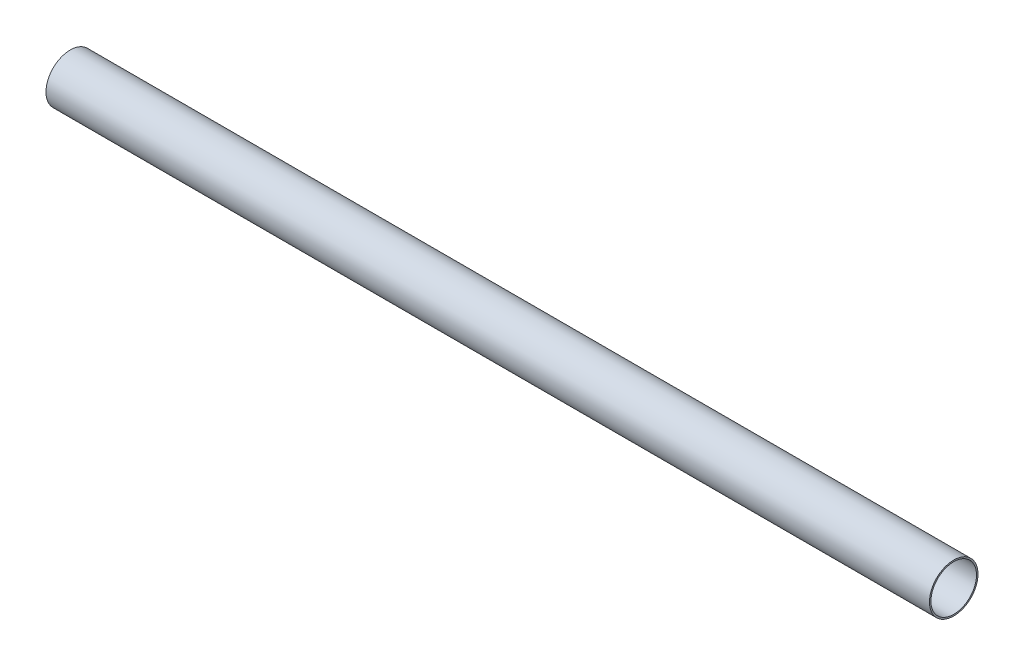
ISO-10303-21;
HEADER;
FILE_DESCRIPTION(('STEP AP214'),'2;1');
FILE_NAME('part.step','',(''),(''),'','','');
FILE_SCHEMA(('AUTOMOTIVE_DESIGN { 1 0 10303 214 1 1 1 1 }'));
ENDSEC;
DATA;
#1=APPLICATION_CONTEXT('core data for automotive mechanical design processes');
#2=APPLICATION_PROTOCOL_DEFINITION('international standard','automotive_design',2000,#1);
#3=PRODUCT_CONTEXT('',#1,'mechanical');
#4=PRODUCT('Part','Part','',(#3));
#5=PRODUCT_RELATED_PRODUCT_CATEGORY('part','',(#4));
#6=PRODUCT_DEFINITION_FORMATION('','',#4);
#7=PRODUCT_DEFINITION_CONTEXT('part definition',#1,'design');
#8=PRODUCT_DEFINITION('design','',#6,#7);
#9=PRODUCT_DEFINITION_SHAPE('','',#8);
#10=(LENGTH_UNIT() NAMED_UNIT(*) SI_UNIT(.MILLI.,.METRE.));
#11=(NAMED_UNIT(*) PLANE_ANGLE_UNIT() SI_UNIT($,.RADIAN.));
#12=(NAMED_UNIT(*) SI_UNIT($,.STERADIAN.) SOLID_ANGLE_UNIT());
#13=UNCERTAINTY_MEASURE_WITH_UNIT(LENGTH_MEASURE(1.E-05),#10,'distance_accuracy_value','');
#14=(GEOMETRIC_REPRESENTATION_CONTEXT(3) GLOBAL_UNCERTAINTY_ASSIGNED_CONTEXT((#13)) GLOBAL_UNIT_ASSIGNED_CONTEXT((#10,
#11,#12)) REPRESENTATION_CONTEXT('',''));
#15=CARTESIAN_POINT('',(0.,0.,0.));
#16=DIRECTION('',(0.,0.,1.));
#17=DIRECTION('',(1.,0.,0.));
#18=AXIS2_PLACEMENT_3D('',#15,#16,#17);
#19=CARTESIAN_POINT('',(147.775700934579,14.5499999999999,0.));
#20=DIRECTION('',(1.,0.,0.));
#21=DIRECTION('',(0.,1.,0.));
#22=AXIS2_PLACEMENT_3D('',#19,#20,#21);
#23=PLANE('',#22);
#24=CARTESIAN_POINT('',(147.775700934579,0.,0.));
#25=DIRECTION('',(1.,0.,0.));
#26=DIRECTION('',(0.,1.,0.));
#27=AXIS2_PLACEMENT_3D('',#24,#25,#26);
#28=CIRCLE('',#27,15.5);
#29=CARTESIAN_POINT('',(147.775700934579,15.5,0.));
#30=VERTEX_POINT('',#29);
#31=EDGE_CURVE('E12',#30,#30,#28,.T.);
#32=ORIENTED_EDGE('',*,*,#31,.T.);
#33=EDGE_LOOP('',(#32));
#34=FACE_BOUND('',#33,.T.);
#35=CARTESIAN_POINT('',(147.775700934579,0.,0.));
#36=DIRECTION('',(1.,0.,0.));
#37=DIRECTION('',(0.,1.,0.));
#38=AXIS2_PLACEMENT_3D('',#35,#36,#37);
#39=CIRCLE('',#38,14.5499999999999);
#40=CARTESIAN_POINT('',(147.775700934579,14.5499999999999,0.));
#41=VERTEX_POINT('',#40);
#42=EDGE_CURVE('E59',#41,#41,#39,.T.);
#43=ORIENTED_EDGE('',*,*,#42,.F.);
#44=EDGE_LOOP('',(#43));
#45=FACE_BOUND('',#44,.T.);
#46=ADVANCED_FACE('F45',(#34,#45),#23,.T.);
#47=CARTESIAN_POINT('',(147.775700934579,0.,0.));
#48=DIRECTION('',(1.,0.,0.));
#49=DIRECTION('',(0.,1.,0.));
#50=AXIS2_PLACEMENT_3D('',#47,#48,#49);
#51=CYLINDRICAL_SURFACE('',#50,15.5);
#52=CARTESIAN_POINT('',(-416.224299065421,0.,0.));
#53=DIRECTION('',(1.,0.,0.));
#54=DIRECTION('',(0.,1.,0.));
#55=AXIS2_PLACEMENT_3D('',#52,#53,#54);
#56=CIRCLE('',#55,15.4999999999999);
#57=CARTESIAN_POINT('',(-416.224299065421,15.4999999999999,0.));
#58=VERTEX_POINT('',#57);
#59=EDGE_CURVE('E51',#58,#58,#56,.T.);
#60=ORIENTED_EDGE('',*,*,#59,.T.);
#61=EDGE_LOOP('',(#60));
#62=FACE_BOUND('',#61,.T.);
#63=ORIENTED_EDGE('',*,*,#31,.F.);
#64=EDGE_LOOP('',(#63));
#65=FACE_BOUND('',#64,.T.);
#66=ADVANCED_FACE('F69',(#62,#65),#51,.T.);
#67=CARTESIAN_POINT('',(-416.224299065421,15.4999999999999,0.));
#68=DIRECTION('',(-1.,0.,0.));
#69=DIRECTION('',(0.,-1.,0.));
#70=AXIS2_PLACEMENT_3D('',#67,#68,#69);
#71=PLANE('',#70);
#72=CARTESIAN_POINT('',(-416.224299065421,0.,0.));
#73=DIRECTION('',(1.,0.,0.));
#74=DIRECTION('',(0.,1.,0.));
#75=AXIS2_PLACEMENT_3D('',#72,#73,#74);
#76=CIRCLE('',#75,14.5499999999999);
#77=CARTESIAN_POINT('',(-416.224299065421,14.5499999999999,0.));
#78=VERTEX_POINT('',#77);
#79=EDGE_CURVE('E55',#78,#78,#76,.T.);
#80=ORIENTED_EDGE('',*,*,#79,.T.);
#81=EDGE_LOOP('',(#80));
#82=FACE_BOUND('',#81,.T.);
#83=ORIENTED_EDGE('',*,*,#59,.F.);
#84=EDGE_LOOP('',(#83));
#85=FACE_BOUND('',#84,.T.);
#86=ADVANCED_FACE('F73',(#82,#85),#71,.T.);
#87=CARTESIAN_POINT('',(147.775700934579,0.,0.));
#88=DIRECTION('',(1.,0.,0.));
#89=DIRECTION('',(0.,1.,0.));
#90=AXIS2_PLACEMENT_3D('',#87,#88,#89);
#91=CYLINDRICAL_SURFACE('',#90,14.5499999999999);
#92=ORIENTED_EDGE('',*,*,#42,.T.);
#93=EDGE_LOOP('',(#92));
#94=FACE_BOUND('',#93,.T.);
#95=ORIENTED_EDGE('',*,*,#79,.F.);
#96=EDGE_LOOP('',(#95));
#97=FACE_BOUND('',#96,.T.);
#98=ADVANCED_FACE('F65',(#94,#97),#91,.F.);
#99=CLOSED_SHELL('',(#46,#66,#86,#98));
#100=MANIFOLD_SOLID_BREP('B2',#99);
#101=ADVANCED_BREP_SHAPE_REPRESENTATION('',(#18,#100),#14);
#102=SHAPE_DEFINITION_REPRESENTATION(#9,#101);
ENDSEC;
END-ISO-10303-21;
